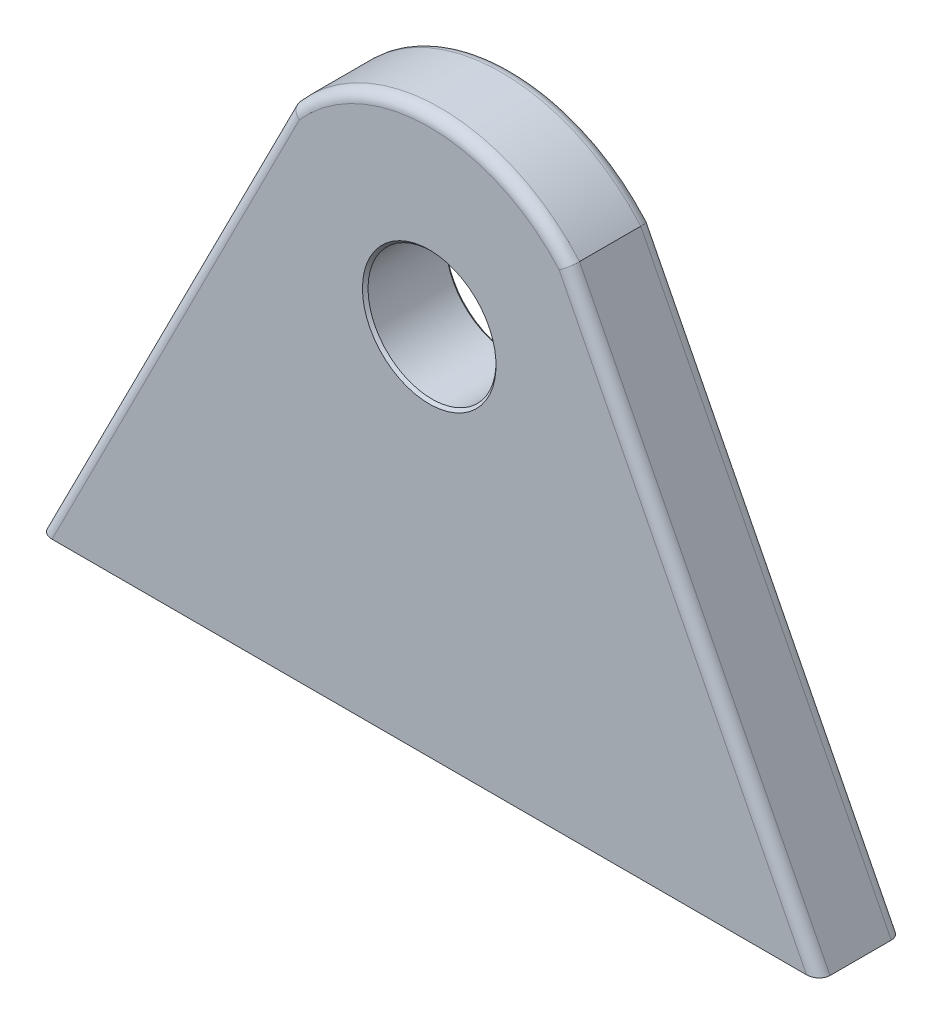
ISO-10303-21;
HEADER;
FILE_DESCRIPTION(('STEP AP214'),'2;1');
FILE_NAME('part.step','',(''),(''),'','','');
FILE_SCHEMA(('AUTOMOTIVE_DESIGN { 1 0 10303 214 1 1 1 1 }'));
ENDSEC;
DATA;
#1=APPLICATION_CONTEXT('core data for automotive mechanical design processes');
#2=APPLICATION_PROTOCOL_DEFINITION('international standard','automotive_design',2000,#1);
#3=PRODUCT_CONTEXT('',#1,'mechanical');
#4=PRODUCT('Part','Part','',(#3));
#5=PRODUCT_RELATED_PRODUCT_CATEGORY('part','',(#4));
#6=PRODUCT_DEFINITION_FORMATION('','',#4);
#7=PRODUCT_DEFINITION_CONTEXT('part definition',#1,'design');
#8=PRODUCT_DEFINITION('design','',#6,#7);
#9=PRODUCT_DEFINITION_SHAPE('','',#8);
#10=(LENGTH_UNIT() NAMED_UNIT(*) SI_UNIT(.MILLI.,.METRE.));
#11=(NAMED_UNIT(*) PLANE_ANGLE_UNIT() SI_UNIT($,.RADIAN.));
#12=(NAMED_UNIT(*) SI_UNIT($,.STERADIAN.) SOLID_ANGLE_UNIT());
#13=UNCERTAINTY_MEASURE_WITH_UNIT(LENGTH_MEASURE(1.E-05),#10,'distance_accuracy_value','');
#14=(GEOMETRIC_REPRESENTATION_CONTEXT(3) GLOBAL_UNCERTAINTY_ASSIGNED_CONTEXT((#13)) GLOBAL_UNIT_ASSIGNED_CONTEXT((#10,
#11,#12)) REPRESENTATION_CONTEXT('',''));
#15=CARTESIAN_POINT('',(0.,0.,0.));
#16=DIRECTION('',(0.,0.,1.));
#17=DIRECTION('',(1.,0.,0.));
#18=AXIS2_PLACEMENT_3D('',#15,#16,#17);
#19=CARTESIAN_POINT('',(0.,66.9202393423755,7.5));
#20=DIRECTION('',(0.,0.,-1.));
#21=DIRECTION('',(-1.,0.,0.));
#22=AXIS2_PLACEMENT_3D('',#19,#20,#21);
#23=PLANE('',#22);
#24=CARTESIAN_POINT('',(0.,66.9202393423755,7.5));
#25=DIRECTION('',(0.,0.,-1.));
#26=DIRECTION('',(-1.,0.,0.));
#27=AXIS2_PLACEMENT_3D('',#24,#25,#26);
#28=CIRCLE('',#27,12.);
#29=CARTESIAN_POINT('',(-12.,66.9202393423755,7.5));
#30=VERTEX_POINT('',#29);
#31=EDGE_CURVE('E11',#30,#30,#28,.T.);
#32=ORIENTED_EDGE('',*,*,#31,.T.);
#33=EDGE_LOOP('',(#32));
#34=FACE_BOUND('',#33,.T.);
#35=CARTESIAN_POINT('',(0.,66.9202393423755,7.5));
#36=DIRECTION('',(0.,0.,-1.));
#37=DIRECTION('',(-1.,0.,0.));
#38=AXIS2_PLACEMENT_3D('',#35,#36,#37);
#39=CIRCLE('',#38,31.0797606576245);
#40=CARTESIAN_POINT('',(23.3296942303893,87.455012037776,7.5));
#41=VERTEX_POINT('',#40);
#42=CARTESIAN_POINT('',(-23.3296942303892,87.455012037776,7.5));
#43=VERTEX_POINT('',#42);
#44=EDGE_CURVE('E48',#41,#43,#39,.F.);
#45=ORIENTED_EDGE('',*,*,#44,.T.);
#46=DIRECTION('',(-0.452909576329467,-0.89155645680409,0.));
#47=VECTOR('',#46,1.);
#48=CARTESIAN_POINT('',(-26.8359694673006,80.5528786094325,7.5));
#49=LINE('',#48,#47);
#50=CARTESIAN_POINT('',(-67.756732078225,0.,7.5));
#51=VERTEX_POINT('',#50);
#52=EDGE_CURVE('E147',#43,#51,#49,.T.);
#53=ORIENTED_EDGE('',*,*,#52,.T.);
#54=DIRECTION('',(1.,0.,0.));
#55=VECTOR('',#54,1.);
#56=CARTESIAN_POINT('',(-70.,0.,7.5));
#57=LINE('',#56,#55);
#58=CARTESIAN_POINT('',(67.756732078225,0.,7.5));
#59=VERTEX_POINT('',#58);
#60=EDGE_CURVE('E103',#51,#59,#57,.T.);
#61=ORIENTED_EDGE('',*,*,#60,.T.);
#62=DIRECTION('',(-0.452909576329467,0.89155645680409,0.));
#63=VECTOR('',#62,1.);
#64=CARTESIAN_POINT('',(26.8359694673006,80.5528786094325,7.5));
#65=LINE('',#64,#63);
#66=EDGE_CURVE('E53',#59,#41,#65,.T.);
#67=ORIENTED_EDGE('',*,*,#66,.T.);
#68=EDGE_LOOP('',(#45,#53,#61,#67));
#69=FACE_BOUND('',#68,.T.);
#70=ADVANCED_FACE('F33',(#34,#69),#23,.F.);
#71=CARTESIAN_POINT('',(0.,66.9202393423755,-7.5));
#72=DIRECTION('',(0.,0.,-1.));
#73=DIRECTION('',(-1.,0.,0.));
#74=AXIS2_PLACEMENT_3D('',#71,#72,#73);
#75=PLANE('',#74);
#76=CARTESIAN_POINT('',(0.,66.9202393423755,-7.5));
#77=DIRECTION('',(0.,0.,-1.));
#78=DIRECTION('',(-1.,0.,0.));
#79=AXIS2_PLACEMENT_3D('',#76,#77,#78);
#80=CIRCLE('',#79,12.);
#81=CARTESIAN_POINT('',(-12.,66.9202393423755,-7.5));
#82=VERTEX_POINT('',#81);
#83=EDGE_CURVE('E149',#82,#82,#80,.F.);
#84=ORIENTED_EDGE('',*,*,#83,.T.);
#85=EDGE_LOOP('',(#84));
#86=FACE_BOUND('',#85,.T.);
#87=DIRECTION('',(1.,0.,0.));
#88=VECTOR('',#87,1.);
#89=CARTESIAN_POINT('',(-70.,0.,-7.5));
#90=LINE('',#89,#88);
#91=CARTESIAN_POINT('',(-67.756732078225,0.,-7.5));
#92=VERTEX_POINT('',#91);
#93=CARTESIAN_POINT('',(67.756732078225,0.,-7.5));
#94=VERTEX_POINT('',#93);
#95=EDGE_CURVE('E337',#92,#94,#90,.T.);
#96=ORIENTED_EDGE('',*,*,#95,.F.);
#97=DIRECTION('',(-0.452909576329467,-0.89155645680409,0.));
#98=VECTOR('',#97,1.);
#99=CARTESIAN_POINT('',(-23.2168870863918,87.6770738860143,-7.5));
#100=LINE('',#99,#98);
#101=CARTESIAN_POINT('',(-23.3296942303892,87.455012037776,-7.5));
#102=VERTEX_POINT('',#101);
#103=EDGE_CURVE('E135',#92,#102,#100,.F.);
#104=ORIENTED_EDGE('',*,*,#103,.T.);
#105=CARTESIAN_POINT('',(0.,66.9202393423755,-7.5));
#106=DIRECTION('',(0.,0.,-1.));
#107=DIRECTION('',(-1.,0.,0.));
#108=AXIS2_PLACEMENT_3D('',#105,#106,#107);
#109=CIRCLE('',#108,31.0797606576245);
#110=CARTESIAN_POINT('',(23.3296942303893,87.455012037776,-7.5));
#111=VERTEX_POINT('',#110);
#112=EDGE_CURVE('E133',#102,#111,#109,.T.);
#113=ORIENTED_EDGE('',*,*,#112,.T.);
#114=DIRECTION('',(-0.452909576329467,0.89155645680409,0.));
#115=VECTOR('',#114,1.);
#116=CARTESIAN_POINT('',(68.2168870863918,-0.905819152658935,-7.5));
#117=LINE('',#116,#115);
#118=EDGE_CURVE('E131',#111,#94,#117,.F.);
#119=ORIENTED_EDGE('',*,*,#118,.T.);
#120=EDGE_LOOP('',(#96,#104,#113,#119));
#121=FACE_BOUND('',#120,.T.);
#122=ADVANCED_FACE('F216',(#86,#121),#75,.T.);
#123=CARTESIAN_POINT('',(-70.,0.,7.5));
#124=DIRECTION('',(0.89155645680409,-0.452909576329467,0.));
#125=DIRECTION('',(0.452909576329467,0.89155645680409,0.));
#126=AXIS2_PLACEMENT_3D('',#123,#124,#125);
#127=PLANE('',#126);
#128=DIRECTION('',(0.,0.,-1.));
#129=VECTOR('',#128,1.);
#130=CARTESIAN_POINT('',(-25.,88.5828930386732,7.5));
#131=LINE('',#130,#129);
#132=CARTESIAN_POINT('',(-25.,88.5828930386732,5.5));
#133=VERTEX_POINT('',#132);
#134=CARTESIAN_POINT('',(-25.,88.5828930386732,-5.5));
#135=VERTEX_POINT('',#134);
#136=EDGE_CURVE('E355',#133,#135,#131,.T.);
#137=ORIENTED_EDGE('',*,*,#136,.T.);
#138=DIRECTION('',(-0.452909576329467,-0.89155645680409,0.));
#139=VECTOR('',#138,1.);
#140=CARTESIAN_POINT('',(-70.,0.,-5.5));
#141=LINE('',#140,#139);
#142=CARTESIAN_POINT('',(-70.,0.,-5.5));
#143=VERTEX_POINT('',#142);
#144=EDGE_CURVE('E117',#135,#143,#141,.T.);
#145=ORIENTED_EDGE('',*,*,#144,.T.);
#146=DIRECTION('',(0.,0.,-1.));
#147=VECTOR('',#146,1.);
#148=CARTESIAN_POINT('',(-70.,0.,7.5));
#149=LINE('',#148,#147);
#150=CARTESIAN_POINT('',(-70.,0.,5.5));
#151=VERTEX_POINT('',#150);
#152=EDGE_CURVE('E102',#151,#143,#149,.T.);
#153=ORIENTED_EDGE('',*,*,#152,.F.);
#154=DIRECTION('',(-0.452909576329467,-0.89155645680409,0.));
#155=VECTOR('',#154,1.);
#156=CARTESIAN_POINT('',(-70.,0.,5.5));
#157=LINE('',#156,#155);
#158=EDGE_CURVE('E114',#151,#133,#157,.F.);
#159=ORIENTED_EDGE('',*,*,#158,.T.);
#160=EDGE_LOOP('',(#137,#145,#153,#159));
#161=FACE_BOUND('',#160,.T.);
#162=ADVANCED_FACE('F113',(#161),#127,.F.);
#163=CARTESIAN_POINT('',(-70.,0.,7.5));
#164=DIRECTION('',(0.,1.,0.));
#165=DIRECTION('',(0.,0.,1.));
#166=AXIS2_PLACEMENT_3D('',#163,#164,#165);
#167=PLANE('',#166);
#168=ORIENTED_EDGE('',*,*,#152,.T.);
#169=CARTESIAN_POINT('',(-67.756732078225,0.,-5.5));
#170=DIRECTION('',(0.,1.,0.));
#171=DIRECTION('',(1.,0.,0.));
#172=AXIS2_PLACEMENT_3D('',#169,#170,#171);
#173=ELLIPSE('',#172,2.24326792177501,2.);
#174=EDGE_CURVE('E129',#143,#92,#173,.F.);
#175=ORIENTED_EDGE('',*,*,#174,.T.);
#176=ORIENTED_EDGE('',*,*,#95,.T.);
#177=CARTESIAN_POINT('',(67.756732078225,0.,-5.5));
#178=DIRECTION('',(0.,1.,0.));
#179=DIRECTION('',(1.,0.,0.));
#180=AXIS2_PLACEMENT_3D('',#177,#178,#179);
#181=ELLIPSE('',#180,2.24326792177501,2.);
#182=CARTESIAN_POINT('',(70.,0.,-5.5));
#183=VERTEX_POINT('',#182);
#184=EDGE_CURVE('E107',#94,#183,#181,.F.);
#185=ORIENTED_EDGE('',*,*,#184,.T.);
#186=DIRECTION('',(0.,0.,-1.));
#187=VECTOR('',#186,1.);
#188=CARTESIAN_POINT('',(70.,0.,7.5));
#189=LINE('',#188,#187);
#190=CARTESIAN_POINT('',(70.,0.,5.5));
#191=VERTEX_POINT('',#190);
#192=EDGE_CURVE('E118',#191,#183,#189,.T.);
#193=ORIENTED_EDGE('',*,*,#192,.F.);
#194=CARTESIAN_POINT('',(67.756732078225,0.,5.5));
#195=DIRECTION('',(0.,1.,0.));
#196=DIRECTION('',(-1.,0.,0.));
#197=AXIS2_PLACEMENT_3D('',#194,#195,#196);
#198=ELLIPSE('',#197,2.24326792177501,2.);
#199=EDGE_CURVE('E108',#191,#59,#198,.F.);
#200=ORIENTED_EDGE('',*,*,#199,.T.);
#201=ORIENTED_EDGE('',*,*,#60,.F.);
#202=CARTESIAN_POINT('',(-67.756732078225,0.,5.5));
#203=DIRECTION('',(0.,1.,0.));
#204=DIRECTION('',(-1.,0.,0.));
#205=AXIS2_PLACEMENT_3D('',#202,#203,#204);
#206=ELLIPSE('',#205,2.24326792177501,2.);
#207=EDGE_CURVE('E99',#51,#151,#206,.F.);
#208=ORIENTED_EDGE('',*,*,#207,.T.);
#209=EDGE_LOOP('',(#168,#175,#176,#185,#193,#200,#201,#208));
#210=FACE_BOUND('',#209,.T.);
#211=ADVANCED_FACE('F101',(#210),#167,.F.);
#212=CARTESIAN_POINT('',(70.,0.,7.5));
#213=DIRECTION('',(-0.89155645680409,-0.452909576329467,0.));
#214=DIRECTION('',(0.452909576329467,-0.89155645680409,0.));
#215=AXIS2_PLACEMENT_3D('',#212,#213,#214);
#216=PLANE('',#215);
#217=ORIENTED_EDGE('',*,*,#192,.T.);
#218=DIRECTION('',(-0.452909576329467,0.89155645680409,0.));
#219=VECTOR('',#218,1.);
#220=CARTESIAN_POINT('',(25.,88.5828930386732,-5.5));
#221=LINE('',#220,#219);
#222=CARTESIAN_POINT('',(25.,88.5828930386732,-5.5));
#223=VERTEX_POINT('',#222);
#224=EDGE_CURVE('E143',#183,#223,#221,.T.);
#225=ORIENTED_EDGE('',*,*,#224,.T.);
#226=DIRECTION('',(0.,0.,-1.));
#227=VECTOR('',#226,1.);
#228=CARTESIAN_POINT('',(25.,88.5828930386732,7.5));
#229=LINE('',#228,#227);
#230=CARTESIAN_POINT('',(25.,88.5828930386732,5.5));
#231=VERTEX_POINT('',#230);
#232=EDGE_CURVE('E354',#231,#223,#229,.T.);
#233=ORIENTED_EDGE('',*,*,#232,.F.);
#234=DIRECTION('',(-0.452909576329467,0.89155645680409,0.));
#235=VECTOR('',#234,1.);
#236=CARTESIAN_POINT('',(70.,0.,5.5));
#237=LINE('',#236,#235);
#238=EDGE_CURVE('E141',#231,#191,#237,.F.);
#239=ORIENTED_EDGE('',*,*,#238,.T.);
#240=EDGE_LOOP('',(#217,#225,#233,#239));
#241=FACE_BOUND('',#240,.T.);
#242=ADVANCED_FACE('F230',(#241),#216,.F.);
#243=CARTESIAN_POINT('',(0.,66.9202393423755,7.5));
#244=DIRECTION('',(0.,0.,-1.));
#245=DIRECTION('',(-1.,0.,0.));
#246=AXIS2_PLACEMENT_3D('',#243,#244,#245);
#247=CYLINDRICAL_SURFACE('',#246,33.0797606576245);
#248=ORIENTED_EDGE('',*,*,#232,.T.);
#249=CARTESIAN_POINT('',(0.,66.9202393423755,-5.5));
#250=DIRECTION('',(0.,0.,-1.));
#251=DIRECTION('',(-1.,0.,0.));
#252=AXIS2_PLACEMENT_3D('',#249,#250,#251);
#253=CIRCLE('',#252,33.0797606576245);
#254=EDGE_CURVE('E139',#223,#135,#253,.F.);
#255=ORIENTED_EDGE('',*,*,#254,.T.);
#256=ORIENTED_EDGE('',*,*,#136,.F.);
#257=CARTESIAN_POINT('',(0.,66.9202393423755,5.5));
#258=DIRECTION('',(0.,0.,-1.));
#259=DIRECTION('',(-1.,0.,0.));
#260=AXIS2_PLACEMENT_3D('',#257,#258,#259);
#261=CIRCLE('',#260,33.0797606576245);
#262=EDGE_CURVE('E137',#133,#231,#261,.T.);
#263=ORIENTED_EDGE('',*,*,#262,.T.);
#264=EDGE_LOOP('',(#248,#255,#256,#263));
#265=FACE_BOUND('',#264,.T.);
#266=ADVANCED_FACE('F227',(#265),#247,.T.);
#267=CARTESIAN_POINT('',(0.,66.9202393423755,7.5));
#268=DIRECTION('',(0.,0.,-1.));
#269=DIRECTION('',(-1.,0.,0.));
#270=AXIS2_PLACEMENT_3D('',#267,#268,#269);
#271=CYLINDRICAL_SURFACE('',#270,11.5);
#272=CARTESIAN_POINT('',(0.,66.9202393423755,-6.99999999999999));
#273=DIRECTION('',(0.,0.,-1.));
#274=DIRECTION('',(-1.,0.,0.));
#275=AXIS2_PLACEMENT_3D('',#272,#273,#274);
#276=CIRCLE('',#275,11.5);
#277=CARTESIAN_POINT('',(-11.5,66.9202393423755,-6.99999999999999));
#278=VERTEX_POINT('',#277);
#279=EDGE_CURVE('E41',#278,#278,#276,.T.);
#280=ORIENTED_EDGE('',*,*,#279,.T.);
#281=EDGE_LOOP('',(#280));
#282=FACE_BOUND('',#281,.T.);
#283=CARTESIAN_POINT('',(0.,66.9202393423755,6.99999999999998));
#284=DIRECTION('',(0.,0.,-1.));
#285=DIRECTION('',(-1.,0.,0.));
#286=AXIS2_PLACEMENT_3D('',#283,#284,#285);
#287=CIRCLE('',#286,11.5);
#288=CARTESIAN_POINT('',(-11.5,66.9202393423755,6.99999999999998));
#289=VERTEX_POINT('',#288);
#290=EDGE_CURVE('E330',#289,#289,#287,.F.);
#291=ORIENTED_EDGE('',*,*,#290,.T.);
#292=EDGE_LOOP('',(#291));
#293=FACE_BOUND('',#292,.T.);
#294=ADVANCED_FACE('F179',(#282,#293),#271,.F.);
#295=CARTESIAN_POINT('',(68.2168870863918,-0.905819152658935,-5.5));
#296=DIRECTION('',(0.452909576329467,-0.89155645680409,0.));
#297=DIRECTION('',(0.89155645680409,0.452909576329467,0.));
#298=AXIS2_PLACEMENT_3D('',#295,#296,#297);
#299=CYLINDRICAL_SURFACE('',#298,2.);
#300=ORIENTED_EDGE('',*,*,#184,.F.);
#301=ORIENTED_EDGE('',*,*,#118,.F.);
#302=CARTESIAN_POINT('',(25.,88.5828930386732,-5.5));
#303=CARTESIAN_POINT('',(24.9999998952961,88.5828929077977,-5.55596120813594));
#304=CARTESIAN_POINT('',(24.9980351254922,88.5815717174735,-5.61189550195809));
#305=CARTESIAN_POINT('',(24.990198247552,88.5763014930089,-5.72336158372298));
#306=CARTESIAN_POINT('',(24.984326382812,88.5723526225624,-5.77889339652085));
#307=CARTESIAN_POINT('',(24.960910727533,88.556604461837,-5.94417524009964));
#308=CARTESIAN_POINT('',(24.9375666941688,88.540903503396,-6.05281440410011));
#309=CARTESIAN_POINT('',(24.8760918282532,88.499544707388,-6.26381790951563));
#310=CARTESIAN_POINT('',(24.8379550137928,88.4738828418238,-6.36617969306421));
#311=CARTESIAN_POINT('',(24.7480246556702,88.4133466642867,-6.56176268680798));
#312=CARTESIAN_POINT('',(24.6962334724516,88.378473944601,-6.65498547305272));
#313=CARTESIAN_POINT('',(24.5803184872203,88.300387676745,-6.82998583914859));
#314=CARTESIAN_POINT('',(24.5161561113522,88.2571480386496,-6.91172620101088));
#315=CARTESIAN_POINT('',(24.3774352993775,88.1636107129892,-7.06119355187729));
#316=CARTESIAN_POINT('',(24.3028734999983,88.1133107420115,-7.12891598967905));
#317=CARTESIAN_POINT('',(24.144929761566,88.0066939800044,-7.24891771760846));
#318=CARTESIAN_POINT('',(24.0614875370492,87.9503360342354,-7.30108093614158));
#319=CARTESIAN_POINT('',(23.888625754379,87.8335027734853,-7.3878616231423));
#320=CARTESIAN_POINT('',(23.7992103210161,87.7730302992622,-7.42249106062479));
#321=CARTESIAN_POINT('',(23.648469364522,87.6710093292473,-7.46454909376373));
#322=CARTESIAN_POINT('',(23.5880973233416,87.6301310381259,-7.47724039088095));
#323=CARTESIAN_POINT('',(23.4666487725397,87.5478581174741,-7.49459400873112));
#324=CARTESIAN_POINT('',(23.4055736080137,87.5064644644228,-7.49926970476587));
#325=CARTESIAN_POINT('',(23.3395823466487,87.4617173321405,-7.49997372026744));
#326=CARTESIAN_POINT('',(23.3346380812786,87.4583646101993,-7.50000006857911));
#327=CARTESIAN_POINT('',(23.3296942303892,87.4550120377759,-7.5));
#328=B_SPLINE_CURVE_WITH_KNOTS('',3,(#302,#303,#304,#305,#306,#307,#308,#309,#310,#311,#312,
#313,#314,#315,#316,#317,#318,#319,#320,#321,#322,#323,#324,#325,#326,#327),.UNSPECIFIED.,.F.,
.F.,(4,2,2,2,2,2,2,2,2,2,2,2,4),(0.,0.167780151290172,0.335549851529997,0.670488835040952,
1.00556340271253,1.34058008366726,1.67665876466484,2.01284638983976,2.35148261293879,
2.68988736143727,2.91152405691347,3.13279055511455,3.15071190829125),.UNSPECIFIED.);
#329=EDGE_CURVE('E159',#223,#111,#328,.T.);
#330=ORIENTED_EDGE('',*,*,#329,.F.);
#331=ORIENTED_EDGE('',*,*,#224,.F.);
#332=EDGE_LOOP('',(#300,#301,#330,#331));
#333=FACE_BOUND('',#332,.T.);
#334=ADVANCED_FACE('F173',(#333),#299,.T.);
#335=CARTESIAN_POINT('',(0.,66.9202393423755,-5.5));
#336=DIRECTION('',(0.,0.,-1.));
#337=DIRECTION('',(-1.,0.,0.));
#338=AXIS2_PLACEMENT_3D('',#335,#336,#337);
#339=TOROIDAL_SURFACE('',#338,31.0797606576245,2.);
#340=ORIENTED_EDGE('',*,*,#329,.T.);
#341=ORIENTED_EDGE('',*,*,#112,.F.);
#342=CARTESIAN_POINT('',(-25.,88.5828930386732,-5.5));
#343=CARTESIAN_POINT('',(-24.9999998952961,88.5828929077977,-5.55596120813594));
#344=CARTESIAN_POINT('',(-24.9980351254922,88.5815717174735,-5.61189550195809));
#345=CARTESIAN_POINT('',(-24.990198247552,88.5763014930089,-5.72336158372298));
#346=CARTESIAN_POINT('',(-24.984326382812,88.5723526225624,-5.77889339652085));
#347=CARTESIAN_POINT('',(-24.960910727533,88.5566044618371,-5.94417524009964));
#348=CARTESIAN_POINT('',(-24.9375666941688,88.540903503396,-6.05281440410011));
#349=CARTESIAN_POINT('',(-24.8760918282532,88.499544707388,-6.26381790951563));
#350=CARTESIAN_POINT('',(-24.8379550137928,88.4738828418238,-6.36617969306421));
#351=CARTESIAN_POINT('',(-24.7480246556702,88.4133466642867,-6.56176268680798));
#352=CARTESIAN_POINT('',(-24.6962334724516,88.378473944601,-6.65498547305272));
#353=CARTESIAN_POINT('',(-24.5803184872203,88.300387676745,-6.8299858391486));
#354=CARTESIAN_POINT('',(-24.5161561113521,88.2571480386496,-6.91172620101088));
#355=CARTESIAN_POINT('',(-24.3774352993775,88.1636107129892,-7.06119355187729));
#356=CARTESIAN_POINT('',(-24.3028734999983,88.1133107420115,-7.12891598967905));
#357=CARTESIAN_POINT('',(-24.144929761566,88.0066939800044,-7.24891771760846));
#358=CARTESIAN_POINT('',(-24.0614875370492,87.9503360342354,-7.30108093614158));
#359=CARTESIAN_POINT('',(-23.888625754379,87.8335027734853,-7.3878616231423));
#360=CARTESIAN_POINT('',(-23.7992103210162,87.7730302992622,-7.42249106062479));
#361=CARTESIAN_POINT('',(-23.648469364522,87.6710093292473,-7.46454909376373));
#362=CARTESIAN_POINT('',(-23.5880973233416,87.630131038126,-7.47724039088094));
#363=CARTESIAN_POINT('',(-23.4666487725398,87.547858117474,-7.49459400873112));
#364=CARTESIAN_POINT('',(-23.4055736080141,87.5064644644224,-7.49926970476587));
#365=CARTESIAN_POINT('',(-23.3395823466487,87.4617173321404,-7.49997372026744));
#366=CARTESIAN_POINT('',(-23.3346380812786,87.4583646101992,-7.50000006857911));
#367=CARTESIAN_POINT('',(-23.3296942303892,87.455012037776,-7.5));
#368=B_SPLINE_CURVE_WITH_KNOTS('',3,(#342,#343,#344,#345,#346,#347,#348,#349,#350,#351,#352,
#353,#354,#355,#356,#357,#358,#359,#360,#361,#362,#363,#364,#365,#366,#367),.UNSPECIFIED.,.F.,
.F.,(4,2,2,2,2,2,2,2,2,2,2,2,4),(0.,0.167780151290172,0.335549851529997,0.670488835040952,
1.00556340271254,1.34058008366726,1.67665876466485,2.01284638983976,2.35148261293879,
2.68988736143727,2.91152405691347,3.13279055511453,3.15071190829124),.UNSPECIFIED.);
#369=EDGE_CURVE('E150',#135,#102,#368,.T.);
#370=ORIENTED_EDGE('',*,*,#369,.F.);
#371=ORIENTED_EDGE('',*,*,#254,.F.);
#372=EDGE_LOOP('',(#340,#341,#370,#371));
#373=FACE_BOUND('',#372,.T.);
#374=ADVANCED_FACE('F170',(#373),#339,.T.);
#375=CARTESIAN_POINT('',(-68.2168870863918,-0.905819152658935,-5.5));
#376=DIRECTION('',(0.452909576329467,0.89155645680409,0.));
#377=DIRECTION('',(-0.89155645680409,0.452909576329467,0.));
#378=AXIS2_PLACEMENT_3D('',#375,#376,#377);
#379=CYLINDRICAL_SURFACE('',#378,2.);
#380=ORIENTED_EDGE('',*,*,#369,.T.);
#381=ORIENTED_EDGE('',*,*,#103,.F.);
#382=ORIENTED_EDGE('',*,*,#174,.F.);
#383=ORIENTED_EDGE('',*,*,#144,.F.);
#384=EDGE_LOOP('',(#380,#381,#382,#383));
#385=FACE_BOUND('',#384,.T.);
#386=ADVANCED_FACE('F167',(#385),#379,.T.);
#387=CARTESIAN_POINT('',(26.8359694673006,80.5528786094325,5.5));
#388=DIRECTION('',(-0.452909576329467,0.89155645680409,0.));
#389=DIRECTION('',(-0.89155645680409,-0.452909576329467,0.));
#390=AXIS2_PLACEMENT_3D('',#387,#388,#389);
#391=CYLINDRICAL_SURFACE('',#390,2.);
#392=ORIENTED_EDGE('',*,*,#199,.F.);
#393=ORIENTED_EDGE('',*,*,#238,.F.);
#394=CARTESIAN_POINT('',(25.,88.5828930386732,5.5));
#395=CARTESIAN_POINT('',(24.9999998952961,88.5828929077977,5.55596120813594));
#396=CARTESIAN_POINT('',(24.9980351254921,88.5815717174736,5.61189550195809));
#397=CARTESIAN_POINT('',(24.9901982475519,88.5763014930089,5.72336158372298));
#398=CARTESIAN_POINT('',(24.984326382812,88.5723526225624,5.77889339652085));
#399=CARTESIAN_POINT('',(24.960910727533,88.556604461837,5.94417524009964));
#400=CARTESIAN_POINT('',(24.9375666941688,88.5409035033959,6.05281440410011));
#401=CARTESIAN_POINT('',(24.8760918282532,88.499544707388,6.26381790951562));
#402=CARTESIAN_POINT('',(24.8379550137928,88.4738828418238,6.36617969306421));
#403=CARTESIAN_POINT('',(24.7480246556702,88.4133466642867,6.56176268680798));
#404=CARTESIAN_POINT('',(24.6962334724516,88.378473944601,6.65498547305272));
#405=CARTESIAN_POINT('',(24.5803184872203,88.300387676745,6.82998583914859));
#406=CARTESIAN_POINT('',(24.5161561113521,88.2571480386496,6.91172620101088));
#407=CARTESIAN_POINT('',(24.3774352993775,88.1636107129893,7.0611935518773));
#408=CARTESIAN_POINT('',(24.3028734999983,88.1133107420115,7.12891598967905));
#409=CARTESIAN_POINT('',(24.144929761566,88.0066939800044,7.24891771760847));
#410=CARTESIAN_POINT('',(24.0614875370492,87.9503360342354,7.30108093614158));
#411=CARTESIAN_POINT('',(23.8886257543789,87.8335027734853,7.38786162314229));
#412=CARTESIAN_POINT('',(23.7992103210161,87.7730302992623,7.42249106062479));
#413=CARTESIAN_POINT('',(23.648469364522,87.6710093292473,7.46454909376373));
#414=CARTESIAN_POINT('',(23.5880973233417,87.6301310381259,7.47724039088094));
#415=CARTESIAN_POINT('',(23.4666487725397,87.5478581174742,7.49459400873111));
#416=CARTESIAN_POINT('',(23.4055736080136,87.5064644644231,7.49926970476587));
#417=CARTESIAN_POINT('',(23.3395823466487,87.4617173321405,7.49997372026744));
#418=CARTESIAN_POINT('',(23.3346380812786,87.4583646101993,7.50000006857911));
#419=CARTESIAN_POINT('',(23.3296942303893,87.455012037776,7.5));
#420=B_SPLINE_CURVE_WITH_KNOTS('',3,(#394,#395,#396,#397,#398,#399,#400,#401,#402,#403,#404,
#405,#406,#407,#408,#409,#410,#411,#412,#413,#414,#415,#416,#417,#418,#419),.UNSPECIFIED.,.F.,
.F.,(4,2,2,2,2,2,2,2,2,2,2,2,4),(0.,0.167780151290173,0.335549851529997,0.670488835040951,
1.00556340271253,1.34058008366726,1.67665876466484,2.01284638983976,2.35148261293879,
2.68988736143727,2.91152405691343,3.13279055511448,3.15071190829119),.UNSPECIFIED.);
#421=EDGE_CURVE('E160',#41,#231,#420,.F.);
#422=ORIENTED_EDGE('',*,*,#421,.F.);
#423=ORIENTED_EDGE('',*,*,#66,.F.);
#424=EDGE_LOOP('',(#392,#393,#422,#423));
#425=FACE_BOUND('',#424,.T.);
#426=ADVANCED_FACE('F185',(#425),#391,.T.);
#427=CARTESIAN_POINT('',(0.,66.9202393423755,5.5));
#428=DIRECTION('',(0.,0.,-1.));
#429=DIRECTION('',(-1.,0.,0.));
#430=AXIS2_PLACEMENT_3D('',#427,#428,#429);
#431=TOROIDAL_SURFACE('',#430,31.0797606576245,2.);
#432=ORIENTED_EDGE('',*,*,#421,.T.);
#433=ORIENTED_EDGE('',*,*,#262,.F.);
#434=CARTESIAN_POINT('',(-25.,88.5828930386732,5.5));
#435=CARTESIAN_POINT('',(-24.9999998952961,88.5828929077977,5.55596120813594));
#436=CARTESIAN_POINT('',(-24.9980351254921,88.5815717174736,5.61189550195809));
#437=CARTESIAN_POINT('',(-24.9901982475519,88.5763014930089,5.72336158372298));
#438=CARTESIAN_POINT('',(-24.984326382812,88.5723526225624,5.77889339652085));
#439=CARTESIAN_POINT('',(-24.960910727533,88.556604461837,5.94417524009964));
#440=CARTESIAN_POINT('',(-24.9375666941688,88.5409035033959,6.05281440410011));
#441=CARTESIAN_POINT('',(-24.8760918282532,88.499544707388,6.26381790951562));
#442=CARTESIAN_POINT('',(-24.8379550137928,88.4738828418238,6.36617969306421));
#443=CARTESIAN_POINT('',(-24.7480246556702,88.4133466642867,6.56176268680798));
#444=CARTESIAN_POINT('',(-24.6962334724516,88.378473944601,6.65498547305272));
#445=CARTESIAN_POINT('',(-24.5803184872203,88.300387676745,6.82998583914859));
#446=CARTESIAN_POINT('',(-24.5161561113521,88.2571480386496,6.91172620101088));
#447=CARTESIAN_POINT('',(-24.3774352993775,88.1636107129893,7.0611935518773));
#448=CARTESIAN_POINT('',(-24.3028734999983,88.1133107420115,7.12891598967905));
#449=CARTESIAN_POINT('',(-24.144929761566,88.0066939800044,7.24891771760846));
#450=CARTESIAN_POINT('',(-24.0614875370492,87.9503360342354,7.30108093614158));
#451=CARTESIAN_POINT('',(-23.8886257543789,87.8335027734853,7.38786162314229));
#452=CARTESIAN_POINT('',(-23.7992103210161,87.7730302992623,7.42249106062479));
#453=CARTESIAN_POINT('',(-23.648469364522,87.6710093292473,7.46454909376373));
#454=CARTESIAN_POINT('',(-23.5880973233417,87.6301310381259,7.47724039088094));
#455=CARTESIAN_POINT('',(-23.4666487725397,87.5478581174742,7.49459400873111));
#456=CARTESIAN_POINT('',(-23.4055736080137,87.5064644644231,7.49926970476587));
#457=CARTESIAN_POINT('',(-23.3395823466487,87.4617173321405,7.49997372026744));
#458=CARTESIAN_POINT('',(-23.3346380812786,87.4583646101993,7.50000006857911));
#459=CARTESIAN_POINT('',(-23.3296942303893,87.455012037776,7.5));
#460=B_SPLINE_CURVE_WITH_KNOTS('',3,(#434,#435,#436,#437,#438,#439,#440,#441,#442,#443,#444,
#445,#446,#447,#448,#449,#450,#451,#452,#453,#454,#455,#456,#457,#458,#459),.UNSPECIFIED.,.F.,
.F.,(4,2,2,2,2,2,2,2,2,2,2,2,4),(0.,0.167780151290173,0.335549851529997,0.670488835040951,
1.00556340271253,1.34058008366726,1.67665876466484,2.01284638983976,2.35148261293879,
2.68988736143727,2.91152405691343,3.13279055511446,3.15071190829118),.UNSPECIFIED.);
#461=EDGE_CURVE('E122',#43,#133,#460,.F.);
#462=ORIENTED_EDGE('',*,*,#461,.F.);
#463=ORIENTED_EDGE('',*,*,#44,.F.);
#464=EDGE_LOOP('',(#432,#433,#462,#463));
#465=FACE_BOUND('',#464,.T.);
#466=ADVANCED_FACE('F181',(#465),#431,.T.);
#467=CARTESIAN_POINT('',(-26.8359694673006,80.5528786094325,5.5));
#468=DIRECTION('',(-0.452909576329467,-0.89155645680409,0.));
#469=DIRECTION('',(0.89155645680409,-0.452909576329467,0.));
#470=AXIS2_PLACEMENT_3D('',#467,#468,#469);
#471=CYLINDRICAL_SURFACE('',#470,2.);
#472=ORIENTED_EDGE('',*,*,#461,.T.);
#473=ORIENTED_EDGE('',*,*,#158,.F.);
#474=ORIENTED_EDGE('',*,*,#207,.F.);
#475=ORIENTED_EDGE('',*,*,#52,.F.);
#476=EDGE_LOOP('',(#472,#473,#474,#475));
#477=FACE_BOUND('',#476,.T.);
#478=ADVANCED_FACE('F121',(#477),#471,.T.);
#479=CARTESIAN_POINT('',(0.,66.9202393423755,-7.5));
#480=DIRECTION('',(0.,0.,-1.));
#481=DIRECTION('',(-1.,0.,0.));
#482=AXIS2_PLACEMENT_3D('',#479,#480,#481);
#483=CONICAL_SURFACE('',#482,12.,0.785398163397459);
#484=ORIENTED_EDGE('',*,*,#279,.F.);
#485=EDGE_LOOP('',(#484));
#486=FACE_BOUND('',#485,.T.);
#487=ORIENTED_EDGE('',*,*,#83,.F.);
#488=EDGE_LOOP('',(#487));
#489=FACE_BOUND('',#488,.T.);
#490=ADVANCED_FACE('F205',(#486,#489),#483,.F.);
#491=CARTESIAN_POINT('',(0.,66.9202393423755,6.99999999999998));
#492=DIRECTION('',(0.,0.,1.));
#493=DIRECTION('',(1.,0.,0.));
#494=AXIS2_PLACEMENT_3D('',#491,#492,#493);
#495=CONICAL_SURFACE('',#494,11.5,0.785398163397466);
#496=ORIENTED_EDGE('',*,*,#31,.F.);
#497=EDGE_LOOP('',(#496));
#498=FACE_BOUND('',#497,.T.);
#499=ORIENTED_EDGE('',*,*,#290,.F.);
#500=EDGE_LOOP('',(#499));
#501=FACE_BOUND('',#500,.T.);
#502=ADVANCED_FACE('F35',(#498,#501),#495,.F.);
#503=CLOSED_SHELL('',(#70,#122,#162,#211,#242,#266,#294,#334,#374,#386,#426,#466,#478,#490,#502));
#504=MANIFOLD_SOLID_BREP('B2',#503);
#505=ADVANCED_BREP_SHAPE_REPRESENTATION('',(#18,#504),#14);
#506=SHAPE_DEFINITION_REPRESENTATION(#9,#505);
ENDSEC;
END-ISO-10303-21;
